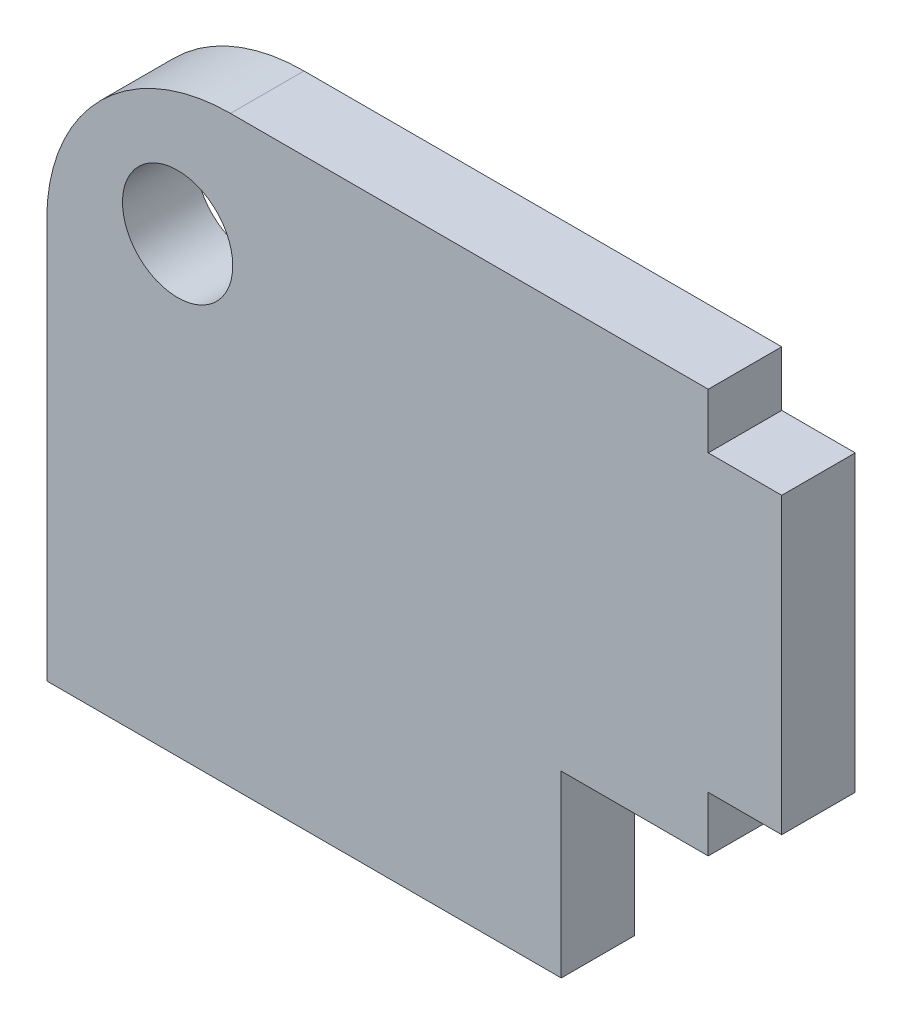
ISO-10303-21;
HEADER;
FILE_DESCRIPTION(('STEP AP214'),'2;1');
FILE_NAME('part.step','',(''),(''),'','','');
FILE_SCHEMA(('AUTOMOTIVE_DESIGN { 1 0 10303 214 1 1 1 1 }'));
ENDSEC;
DATA;
#1=APPLICATION_CONTEXT('core data for automotive mechanical design processes');
#2=APPLICATION_PROTOCOL_DEFINITION('international standard','automotive_design',2000,#1);
#3=PRODUCT_CONTEXT('',#1,'mechanical');
#4=PRODUCT('Part','Part','',(#3));
#5=PRODUCT_RELATED_PRODUCT_CATEGORY('part','',(#4));
#6=PRODUCT_DEFINITION_FORMATION('','',#4);
#7=PRODUCT_DEFINITION_CONTEXT('part definition',#1,'design');
#8=PRODUCT_DEFINITION('design','',#6,#7);
#9=PRODUCT_DEFINITION_SHAPE('','',#8);
#10=(LENGTH_UNIT() NAMED_UNIT(*) SI_UNIT(.MILLI.,.METRE.));
#11=(NAMED_UNIT(*) PLANE_ANGLE_UNIT() SI_UNIT($,.RADIAN.));
#12=(NAMED_UNIT(*) SI_UNIT($,.STERADIAN.) SOLID_ANGLE_UNIT());
#13=UNCERTAINTY_MEASURE_WITH_UNIT(LENGTH_MEASURE(1.E-05),#10,'distance_accuracy_value','');
#14=(GEOMETRIC_REPRESENTATION_CONTEXT(3) GLOBAL_UNCERTAINTY_ASSIGNED_CONTEXT((#13)) GLOBAL_UNIT_ASSIGNED_CONTEXT((#10,
#11,#12)) REPRESENTATION_CONTEXT('',''));
#15=CARTESIAN_POINT('',(0.,0.,0.));
#16=DIRECTION('',(0.,0.,1.));
#17=DIRECTION('',(1.,0.,0.));
#18=AXIS2_PLACEMENT_3D('',#15,#16,#17);
#19=CARTESIAN_POINT('',(-5.,2.93781329910027,2.));
#20=DIRECTION('',(0.,0.,-1.));
#21=DIRECTION('',(-1.,0.,0.));
#22=AXIS2_PLACEMENT_3D('',#19,#20,#21);
#23=PLANE('',#22);
#24=CARTESIAN_POINT('',(-5.,2.93781329910027,2.));
#25=DIRECTION('',(0.,0.,1.));
#26=DIRECTION('',(-1.,0.,0.));
#27=AXIS2_PLACEMENT_3D('',#24,#25,#26);
#28=CIRCLE('',#27,5.);
#29=CARTESIAN_POINT('',(-4.99999999999996,7.93781329910027,2.));
#30=VERTEX_POINT('',#29);
#31=CARTESIAN_POINT('',(-10.,2.93781329910024,2.));
#32=VERTEX_POINT('',#31);
#33=EDGE_CURVE('E169',#30,#32,#28,.T.);
#34=ORIENTED_EDGE('',*,*,#33,.T.);
#35=DIRECTION('',(0.,-1.,0.));
#36=VECTOR('',#35,1.);
#37=CARTESIAN_POINT('',(-10.,-7.93781329910027,2.));
#38=LINE('',#37,#36);
#39=CARTESIAN_POINT('',(-10.,-7.93781329910027,2.));
#40=VERTEX_POINT('',#39);
#41=EDGE_CURVE('E102',#32,#40,#38,.T.);
#42=ORIENTED_EDGE('',*,*,#41,.T.);
#43=DIRECTION('',(1.,0.,0.));
#44=VECTOR('',#43,1.);
#45=CARTESIAN_POINT('',(4.,-7.93781329910027,2.));
#46=LINE('',#45,#44);
#47=CARTESIAN_POINT('',(4.,-7.93781329910027,2.));
#48=VERTEX_POINT('',#47);
#49=EDGE_CURVE('E193',#40,#48,#46,.T.);
#50=ORIENTED_EDGE('',*,*,#49,.T.);
#51=DIRECTION('',(0.,1.,0.));
#52=VECTOR('',#51,1.);
#53=CARTESIAN_POINT('',(4.,-7.93781329910027,2.));
#54=LINE('',#53,#52);
#55=CARTESIAN_POINT('',(4.,-3.06218670089968,2.));
#56=VERTEX_POINT('',#55);
#57=EDGE_CURVE('E212',#48,#56,#54,.T.);
#58=ORIENTED_EDGE('',*,*,#57,.T.);
#59=DIRECTION('',(1.,0.,0.));
#60=VECTOR('',#59,1.);
#61=CARTESIAN_POINT('',(8.,-3.06218670089968,2.));
#62=LINE('',#61,#60);
#63=CARTESIAN_POINT('',(8.,-3.06218670089968,2.));
#64=VERTEX_POINT('',#63);
#65=EDGE_CURVE('E209',#56,#64,#62,.T.);
#66=ORIENTED_EDGE('',*,*,#65,.T.);
#67=DIRECTION('',(0.,1.,0.));
#68=VECTOR('',#67,1.);
#69=CARTESIAN_POINT('',(8.,-1.5621867008997,2.));
#70=LINE('',#69,#68);
#71=CARTESIAN_POINT('',(8.,-1.5621867008997,2.));
#72=VERTEX_POINT('',#71);
#73=EDGE_CURVE('E211',#64,#72,#70,.T.);
#74=ORIENTED_EDGE('',*,*,#73,.T.);
#75=DIRECTION('',(1.,0.,0.));
#76=VECTOR('',#75,1.);
#77=CARTESIAN_POINT('',(10.,-1.5621867008997,2.));
#78=LINE('',#77,#76);
#79=CARTESIAN_POINT('',(10.,-1.5621867008997,2.));
#80=VERTEX_POINT('',#79);
#81=EDGE_CURVE('E214',#72,#80,#78,.T.);
#82=ORIENTED_EDGE('',*,*,#81,.T.);
#83=DIRECTION('',(0.,1.,0.));
#84=VECTOR('',#83,1.);
#85=CARTESIAN_POINT('',(10.,6.4378132991003,2.));
#86=LINE('',#85,#84);
#87=CARTESIAN_POINT('',(10.,6.4378132991003,2.));
#88=VERTEX_POINT('',#87);
#89=EDGE_CURVE('E130',#80,#88,#86,.T.);
#90=ORIENTED_EDGE('',*,*,#89,.T.);
#91=DIRECTION('',(-1.,0.,0.));
#92=VECTOR('',#91,1.);
#93=CARTESIAN_POINT('',(10.,6.4378132991003,2.));
#94=LINE('',#93,#92);
#95=CARTESIAN_POINT('',(8.,6.4378132991003,2.));
#96=VERTEX_POINT('',#95);
#97=EDGE_CURVE('E124',#88,#96,#94,.T.);
#98=ORIENTED_EDGE('',*,*,#97,.T.);
#99=DIRECTION('',(0.,1.,0.));
#100=VECTOR('',#99,1.);
#101=CARTESIAN_POINT('',(8.,6.4378132991003,2.));
#102=LINE('',#101,#100);
#103=CARTESIAN_POINT('',(8.,7.93781329910027,2.));
#104=VERTEX_POINT('',#103);
#105=EDGE_CURVE('E128',#96,#104,#102,.T.);
#106=ORIENTED_EDGE('',*,*,#105,.T.);
#107=DIRECTION('',(-1.,0.,0.));
#108=VECTOR('',#107,1.);
#109=CARTESIAN_POINT('',(-4.99999999999996,7.93781329910027,2.));
#110=LINE('',#109,#108);
#111=EDGE_CURVE('E50',#104,#30,#110,.T.);
#112=ORIENTED_EDGE('',*,*,#111,.T.);
#113=EDGE_LOOP('',(#34,#42,#50,#58,#66,#74,#82,#90,#98,#106,#112));
#114=FACE_BOUND('',#113,.T.);
#115=CARTESIAN_POINT('',(-6.43933982822016,4.37715312732044,2.));
#116=DIRECTION('',(0.,0.,1.));
#117=DIRECTION('',(1.,0.,0.));
#118=AXIS2_PLACEMENT_3D('',#115,#116,#117);
#119=CIRCLE('',#118,1.5);
#120=CARTESIAN_POINT('',(-4.93933982822016,4.37715312732044,2.));
#121=VERTEX_POINT('',#120);
#122=EDGE_CURVE('E152',#121,#121,#119,.T.);
#123=ORIENTED_EDGE('',*,*,#122,.F.);
#124=EDGE_LOOP('',(#123));
#125=FACE_BOUND('',#124,.T.);
#126=ADVANCED_FACE('F33',(#114,#125),#23,.F.);
#127=CARTESIAN_POINT('',(-5.,2.93781329910027,0.));
#128=DIRECTION('',(0.,0.,-1.));
#129=DIRECTION('',(-1.,0.,0.));
#130=AXIS2_PLACEMENT_3D('',#127,#128,#129);
#131=PLANE('',#130);
#132=CARTESIAN_POINT('',(-5.,2.93781329910027,0.));
#133=DIRECTION('',(0.,0.,1.));
#134=DIRECTION('',(-1.,0.,0.));
#135=AXIS2_PLACEMENT_3D('',#132,#133,#134);
#136=CIRCLE('',#135,5.);
#137=CARTESIAN_POINT('',(-4.99999999999996,7.93781329910027,0.));
#138=VERTEX_POINT('',#137);
#139=CARTESIAN_POINT('',(-10.,2.93781329910024,0.));
#140=VERTEX_POINT('',#139);
#141=EDGE_CURVE('E148',#138,#140,#136,.T.);
#142=ORIENTED_EDGE('',*,*,#141,.F.);
#143=DIRECTION('',(-1.,0.,0.));
#144=VECTOR('',#143,1.);
#145=CARTESIAN_POINT('',(-4.99999999999996,7.93781329910027,0.));
#146=LINE('',#145,#144);
#147=CARTESIAN_POINT('',(8.,7.93781329910027,0.));
#148=VERTEX_POINT('',#147);
#149=EDGE_CURVE('E94',#148,#138,#146,.T.);
#150=ORIENTED_EDGE('',*,*,#149,.F.);
#151=DIRECTION('',(0.,1.,0.));
#152=VECTOR('',#151,1.);
#153=CARTESIAN_POINT('',(8.,6.4378132991003,0.));
#154=LINE('',#153,#152);
#155=CARTESIAN_POINT('',(8.,6.4378132991003,0.));
#156=VERTEX_POINT('',#155);
#157=EDGE_CURVE('E88',#156,#148,#154,.T.);
#158=ORIENTED_EDGE('',*,*,#157,.F.);
#159=DIRECTION('',(-1.,0.,0.));
#160=VECTOR('',#159,1.);
#161=CARTESIAN_POINT('',(10.,6.4378132991003,0.));
#162=LINE('',#161,#160);
#163=CARTESIAN_POINT('',(10.,6.4378132991003,0.));
#164=VERTEX_POINT('',#163);
#165=EDGE_CURVE('E138',#164,#156,#162,.T.);
#166=ORIENTED_EDGE('',*,*,#165,.F.);
#167=DIRECTION('',(0.,1.,0.));
#168=VECTOR('',#167,1.);
#169=CARTESIAN_POINT('',(10.,6.4378132991003,0.));
#170=LINE('',#169,#168);
#171=CARTESIAN_POINT('',(10.,-1.5621867008997,0.));
#172=VERTEX_POINT('',#171);
#173=EDGE_CURVE('E164',#172,#164,#170,.T.);
#174=ORIENTED_EDGE('',*,*,#173,.F.);
#175=DIRECTION('',(1.,0.,0.));
#176=VECTOR('',#175,1.);
#177=CARTESIAN_POINT('',(10.,-1.5621867008997,0.));
#178=LINE('',#177,#176);
#179=CARTESIAN_POINT('',(8.,-1.5621867008997,0.));
#180=VERTEX_POINT('',#179);
#181=EDGE_CURVE('E162',#180,#172,#178,.T.);
#182=ORIENTED_EDGE('',*,*,#181,.F.);
#183=DIRECTION('',(0.,1.,0.));
#184=VECTOR('',#183,1.);
#185=CARTESIAN_POINT('',(8.,-1.5621867008997,0.));
#186=LINE('',#185,#184);
#187=CARTESIAN_POINT('',(8.,-3.06218670089968,0.));
#188=VERTEX_POINT('',#187);
#189=EDGE_CURVE('E160',#188,#180,#186,.T.);
#190=ORIENTED_EDGE('',*,*,#189,.F.);
#191=DIRECTION('',(1.,0.,0.));
#192=VECTOR('',#191,1.);
#193=CARTESIAN_POINT('',(8.,-3.06218670089968,0.));
#194=LINE('',#193,#192);
#195=CARTESIAN_POINT('',(4.,-3.06218670089968,0.));
#196=VERTEX_POINT('',#195);
#197=EDGE_CURVE('E158',#196,#188,#194,.T.);
#198=ORIENTED_EDGE('',*,*,#197,.F.);
#199=DIRECTION('',(0.,1.,0.));
#200=VECTOR('',#199,1.);
#201=CARTESIAN_POINT('',(4.,-7.93781329910027,0.));
#202=LINE('',#201,#200);
#203=CARTESIAN_POINT('',(4.,-7.93781329910027,0.));
#204=VERTEX_POINT('',#203);
#205=EDGE_CURVE('E156',#204,#196,#202,.T.);
#206=ORIENTED_EDGE('',*,*,#205,.F.);
#207=DIRECTION('',(1.,0.,0.));
#208=VECTOR('',#207,1.);
#209=CARTESIAN_POINT('',(4.,-7.93781329910027,0.));
#210=LINE('',#209,#208);
#211=CARTESIAN_POINT('',(-10.,-7.93781329910027,0.));
#212=VERTEX_POINT('',#211);
#213=EDGE_CURVE('E154',#212,#204,#210,.T.);
#214=ORIENTED_EDGE('',*,*,#213,.F.);
#215=DIRECTION('',(0.,-1.,0.));
#216=VECTOR('',#215,1.);
#217=CARTESIAN_POINT('',(-10.,-7.93781329910027,0.));
#218=LINE('',#217,#216);
#219=EDGE_CURVE('E151',#140,#212,#218,.T.);
#220=ORIENTED_EDGE('',*,*,#219,.F.);
#221=EDGE_LOOP('',(#142,#150,#158,#166,#174,#182,#190,#198,#206,#214,#220));
#222=FACE_BOUND('',#221,.T.);
#223=CARTESIAN_POINT('',(-6.43933982822016,4.37715312732044,0.));
#224=DIRECTION('',(0.,0.,1.));
#225=DIRECTION('',(1.,0.,0.));
#226=AXIS2_PLACEMENT_3D('',#223,#224,#225);
#227=CIRCLE('',#226,1.5);
#228=CARTESIAN_POINT('',(-4.93933982822016,4.37715312732044,0.));
#229=VERTEX_POINT('',#228);
#230=EDGE_CURVE('E352',#229,#229,#227,.T.);
#231=ORIENTED_EDGE('',*,*,#230,.T.);
#232=EDGE_LOOP('',(#231));
#233=FACE_BOUND('',#232,.T.);
#234=ADVANCED_FACE('F197',(#222,#233),#131,.T.);
#235=CARTESIAN_POINT('',(-5.,2.93781329910027,2.));
#236=DIRECTION('',(0.,0.,-1.));
#237=DIRECTION('',(-1.,0.,0.));
#238=AXIS2_PLACEMENT_3D('',#235,#236,#237);
#239=CYLINDRICAL_SURFACE('',#238,5.);
#240=ORIENTED_EDGE('',*,*,#141,.T.);
#241=DIRECTION('',(0.,0.,-1.));
#242=VECTOR('',#241,1.);
#243=CARTESIAN_POINT('',(-10.,2.93781329910024,2.));
#244=LINE('',#243,#242);
#245=EDGE_CURVE('E11',#32,#140,#244,.T.);
#246=ORIENTED_EDGE('',*,*,#245,.F.);
#247=ORIENTED_EDGE('',*,*,#33,.F.);
#248=DIRECTION('',(0.,0.,-1.));
#249=VECTOR('',#248,1.);
#250=CARTESIAN_POINT('',(-4.99999999999996,7.93781329910027,2.));
#251=LINE('',#250,#249);
#252=EDGE_CURVE('E144',#30,#138,#251,.T.);
#253=ORIENTED_EDGE('',*,*,#252,.T.);
#254=EDGE_LOOP('',(#240,#246,#247,#253));
#255=FACE_BOUND('',#254,.T.);
#256=ADVANCED_FACE('F35',(#255),#239,.T.);
#257=CARTESIAN_POINT('',(-10.,-7.93781329910027,2.));
#258=DIRECTION('',(1.,0.,0.));
#259=DIRECTION('',(0.,0.,-1.));
#260=AXIS2_PLACEMENT_3D('',#257,#258,#259);
#261=PLANE('',#260);
#262=ORIENTED_EDGE('',*,*,#219,.T.);
#263=DIRECTION('',(0.,0.,-1.));
#264=VECTOR('',#263,1.);
#265=CARTESIAN_POINT('',(-10.,-7.93781329910027,2.));
#266=LINE('',#265,#264);
#267=EDGE_CURVE('E42',#40,#212,#266,.T.);
#268=ORIENTED_EDGE('',*,*,#267,.F.);
#269=ORIENTED_EDGE('',*,*,#41,.F.);
#270=ORIENTED_EDGE('',*,*,#245,.T.);
#271=EDGE_LOOP('',(#262,#268,#269,#270));
#272=FACE_BOUND('',#271,.T.);
#273=ADVANCED_FACE('F251',(#272),#261,.F.);
#274=CARTESIAN_POINT('',(4.,-7.93781329910027,2.));
#275=DIRECTION('',(0.,1.,0.));
#276=DIRECTION('',(0.,0.,1.));
#277=AXIS2_PLACEMENT_3D('',#274,#275,#276);
#278=PLANE('',#277);
#279=ORIENTED_EDGE('',*,*,#213,.T.);
#280=DIRECTION('',(0.,0.,-1.));
#281=VECTOR('',#280,1.);
#282=CARTESIAN_POINT('',(4.,-7.93781329910027,2.));
#283=LINE('',#282,#281);
#284=EDGE_CURVE('E185',#48,#204,#283,.T.);
#285=ORIENTED_EDGE('',*,*,#284,.F.);
#286=ORIENTED_EDGE('',*,*,#49,.F.);
#287=ORIENTED_EDGE('',*,*,#267,.T.);
#288=EDGE_LOOP('',(#279,#285,#286,#287));
#289=FACE_BOUND('',#288,.T.);
#290=ADVANCED_FACE('F191',(#289),#278,.F.);
#291=CARTESIAN_POINT('',(4.,-7.93781329910027,2.));
#292=DIRECTION('',(-1.,0.,0.));
#293=DIRECTION('',(0.,-1.,0.));
#294=AXIS2_PLACEMENT_3D('',#291,#292,#293);
#295=PLANE('',#294);
#296=ORIENTED_EDGE('',*,*,#205,.T.);
#297=DIRECTION('',(0.,0.,-1.));
#298=VECTOR('',#297,1.);
#299=CARTESIAN_POINT('',(4.,-3.06218670089968,2.));
#300=LINE('',#299,#298);
#301=EDGE_CURVE('E182',#56,#196,#300,.T.);
#302=ORIENTED_EDGE('',*,*,#301,.F.);
#303=ORIENTED_EDGE('',*,*,#57,.F.);
#304=ORIENTED_EDGE('',*,*,#284,.T.);
#305=EDGE_LOOP('',(#296,#302,#303,#304));
#306=FACE_BOUND('',#305,.T.);
#307=ADVANCED_FACE('F203',(#306),#295,.F.);
#308=CARTESIAN_POINT('',(8.,-3.06218670089968,2.));
#309=DIRECTION('',(0.,1.,0.));
#310=DIRECTION('',(-1.,0.,0.));
#311=AXIS2_PLACEMENT_3D('',#308,#309,#310);
#312=PLANE('',#311);
#313=ORIENTED_EDGE('',*,*,#197,.T.);
#314=DIRECTION('',(0.,0.,-1.));
#315=VECTOR('',#314,1.);
#316=CARTESIAN_POINT('',(8.,-3.06218670089968,2.));
#317=LINE('',#316,#315);
#318=EDGE_CURVE('E179',#64,#188,#317,.T.);
#319=ORIENTED_EDGE('',*,*,#318,.F.);
#320=ORIENTED_EDGE('',*,*,#65,.F.);
#321=ORIENTED_EDGE('',*,*,#301,.T.);
#322=EDGE_LOOP('',(#313,#319,#320,#321));
#323=FACE_BOUND('',#322,.T.);
#324=ADVANCED_FACE('F207',(#323),#312,.F.);
#325=CARTESIAN_POINT('',(8.,-1.5621867008997,2.));
#326=DIRECTION('',(-1.,0.,0.));
#327=DIRECTION('',(0.,0.,1.));
#328=AXIS2_PLACEMENT_3D('',#325,#326,#327);
#329=PLANE('',#328);
#330=ORIENTED_EDGE('',*,*,#189,.T.);
#331=DIRECTION('',(0.,0.,-1.));
#332=VECTOR('',#331,1.);
#333=CARTESIAN_POINT('',(8.,-1.5621867008997,2.));
#334=LINE('',#333,#332);
#335=EDGE_CURVE('E176',#72,#180,#334,.T.);
#336=ORIENTED_EDGE('',*,*,#335,.F.);
#337=ORIENTED_EDGE('',*,*,#73,.F.);
#338=ORIENTED_EDGE('',*,*,#318,.T.);
#339=EDGE_LOOP('',(#330,#336,#337,#338));
#340=FACE_BOUND('',#339,.T.);
#341=ADVANCED_FACE('F264',(#340),#329,.F.);
#342=CARTESIAN_POINT('',(10.,-1.5621867008997,2.));
#343=DIRECTION('',(0.,1.,0.));
#344=DIRECTION('',(-1.,0.,0.));
#345=AXIS2_PLACEMENT_3D('',#342,#343,#344);
#346=PLANE('',#345);
#347=ORIENTED_EDGE('',*,*,#181,.T.);
#348=DIRECTION('',(0.,0.,-1.));
#349=VECTOR('',#348,1.);
#350=CARTESIAN_POINT('',(10.,-1.5621867008997,2.));
#351=LINE('',#350,#349);
#352=EDGE_CURVE('E173',#80,#172,#351,.T.);
#353=ORIENTED_EDGE('',*,*,#352,.F.);
#354=ORIENTED_EDGE('',*,*,#81,.F.);
#355=ORIENTED_EDGE('',*,*,#335,.T.);
#356=EDGE_LOOP('',(#347,#353,#354,#355));
#357=FACE_BOUND('',#356,.T.);
#358=ADVANCED_FACE('F223',(#357),#346,.F.);
#359=CARTESIAN_POINT('',(10.,6.4378132991003,2.));
#360=DIRECTION('',(-1.,0.,0.));
#361=DIRECTION('',(0.,-1.,0.));
#362=AXIS2_PLACEMENT_3D('',#359,#360,#361);
#363=PLANE('',#362);
#364=ORIENTED_EDGE('',*,*,#173,.T.);
#365=DIRECTION('',(0.,0.,-1.));
#366=VECTOR('',#365,1.);
#367=CARTESIAN_POINT('',(10.,6.4378132991003,2.));
#368=LINE('',#367,#366);
#369=EDGE_CURVE('E139',#88,#164,#368,.T.);
#370=ORIENTED_EDGE('',*,*,#369,.F.);
#371=ORIENTED_EDGE('',*,*,#89,.F.);
#372=ORIENTED_EDGE('',*,*,#352,.T.);
#373=EDGE_LOOP('',(#364,#370,#371,#372));
#374=FACE_BOUND('',#373,.T.);
#375=ADVANCED_FACE('F227',(#374),#363,.F.);
#376=CARTESIAN_POINT('',(10.,6.4378132991003,2.));
#377=DIRECTION('',(0.,-1.,0.));
#378=DIRECTION('',(0.,0.,-1.));
#379=AXIS2_PLACEMENT_3D('',#376,#377,#378);
#380=PLANE('',#379);
#381=ORIENTED_EDGE('',*,*,#165,.T.);
#382=DIRECTION('',(0.,0.,-1.));
#383=VECTOR('',#382,1.);
#384=CARTESIAN_POINT('',(8.,6.4378132991003,2.));
#385=LINE('',#384,#383);
#386=EDGE_CURVE('E135',#96,#156,#385,.T.);
#387=ORIENTED_EDGE('',*,*,#386,.F.);
#388=ORIENTED_EDGE('',*,*,#97,.F.);
#389=ORIENTED_EDGE('',*,*,#369,.T.);
#390=EDGE_LOOP('',(#381,#387,#388,#389));
#391=FACE_BOUND('',#390,.T.);
#392=ADVANCED_FACE('F136',(#391),#380,.F.);
#393=CARTESIAN_POINT('',(8.,6.4378132991003,2.));
#394=DIRECTION('',(-1.,0.,0.));
#395=DIRECTION('',(0.,0.,1.));
#396=AXIS2_PLACEMENT_3D('',#393,#394,#395);
#397=PLANE('',#396);
#398=ORIENTED_EDGE('',*,*,#157,.T.);
#399=DIRECTION('',(0.,0.,-1.));
#400=VECTOR('',#399,1.);
#401=CARTESIAN_POINT('',(8.,7.93781329910027,2.));
#402=LINE('',#401,#400);
#403=EDGE_CURVE('E140',#104,#148,#402,.T.);
#404=ORIENTED_EDGE('',*,*,#403,.F.);
#405=ORIENTED_EDGE('',*,*,#105,.F.);
#406=ORIENTED_EDGE('',*,*,#386,.T.);
#407=EDGE_LOOP('',(#398,#404,#405,#406));
#408=FACE_BOUND('',#407,.T.);
#409=ADVANCED_FACE('F142',(#408),#397,.F.);
#410=CARTESIAN_POINT('',(-4.99999999999996,7.93781329910027,2.));
#411=DIRECTION('',(0.,-1.,0.));
#412=DIRECTION('',(0.,0.,-1.));
#413=AXIS2_PLACEMENT_3D('',#410,#411,#412);
#414=PLANE('',#413);
#415=ORIENTED_EDGE('',*,*,#149,.T.);
#416=ORIENTED_EDGE('',*,*,#252,.F.);
#417=ORIENTED_EDGE('',*,*,#111,.F.);
#418=ORIENTED_EDGE('',*,*,#403,.T.);
#419=EDGE_LOOP('',(#415,#416,#417,#418));
#420=FACE_BOUND('',#419,.T.);
#421=ADVANCED_FACE('F231',(#420),#414,.F.);
#422=CARTESIAN_POINT('',(-6.43933982822016,4.37715312732044,2.));
#423=DIRECTION('',(0.,0.,-1.));
#424=DIRECTION('',(-1.,0.,0.));
#425=AXIS2_PLACEMENT_3D('',#422,#423,#424);
#426=CYLINDRICAL_SURFACE('',#425,1.5);
#427=ORIENTED_EDGE('',*,*,#122,.T.);
#428=EDGE_LOOP('',(#427));
#429=FACE_BOUND('',#428,.T.);
#430=ORIENTED_EDGE('',*,*,#230,.F.);
#431=EDGE_LOOP('',(#430));
#432=FACE_BOUND('',#431,.T.);
#433=ADVANCED_FACE('F233',(#429,#432),#426,.F.);
#434=CLOSED_SHELL('',(#126,#234,#256,#273,#290,#307,#324,#341,#358,#375,#392,#409,#421,#433));
#435=MANIFOLD_SOLID_BREP('B2',#434);
#436=ADVANCED_BREP_SHAPE_REPRESENTATION('',(#18,#435),#14);
#437=SHAPE_DEFINITION_REPRESENTATION(#9,#436);
ENDSEC;
END-ISO-10303-21;
